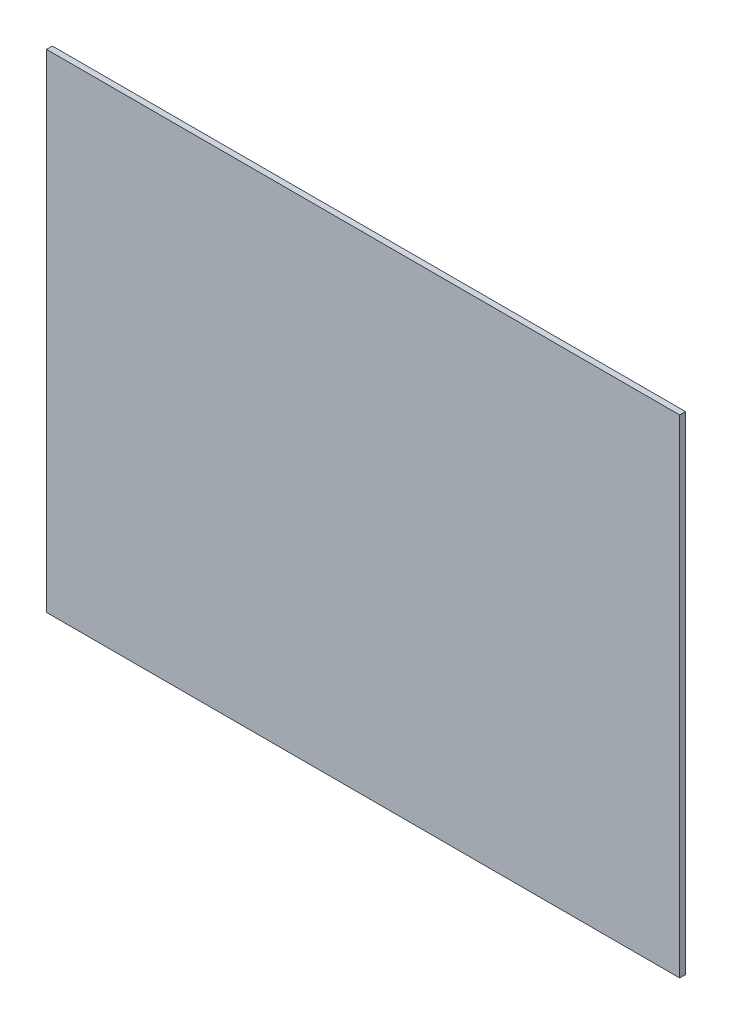
ISO-10303-21;
HEADER;
FILE_DESCRIPTION(('STEP AP214'),'2;1');
FILE_NAME('part.step','',(''),(''),'','','');
FILE_SCHEMA(('AUTOMOTIVE_DESIGN { 1 0 10303 214 1 1 1 1 }'));
ENDSEC;
DATA;
#1=APPLICATION_CONTEXT('core data for automotive mechanical design processes');
#2=APPLICATION_PROTOCOL_DEFINITION('international standard','automotive_design',2000,#1);
#3=PRODUCT_CONTEXT('',#1,'mechanical');
#4=PRODUCT('Part','Part','',(#3));
#5=PRODUCT_RELATED_PRODUCT_CATEGORY('part','',(#4));
#6=PRODUCT_DEFINITION_FORMATION('','',#4);
#7=PRODUCT_DEFINITION_CONTEXT('part definition',#1,'design');
#8=PRODUCT_DEFINITION('design','',#6,#7);
#9=PRODUCT_DEFINITION_SHAPE('','',#8);
#10=(LENGTH_UNIT() NAMED_UNIT(*) SI_UNIT(.MILLI.,.METRE.));
#11=(NAMED_UNIT(*) PLANE_ANGLE_UNIT() SI_UNIT($,.RADIAN.));
#12=(NAMED_UNIT(*) SI_UNIT($,.STERADIAN.) SOLID_ANGLE_UNIT());
#13=UNCERTAINTY_MEASURE_WITH_UNIT(LENGTH_MEASURE(1.E-05),#10,'distance_accuracy_value','');
#14=(GEOMETRIC_REPRESENTATION_CONTEXT(3) GLOBAL_UNCERTAINTY_ASSIGNED_CONTEXT((#13)) GLOBAL_UNIT_ASSIGNED_CONTEXT((#10,
#11,#12)) REPRESENTATION_CONTEXT('',''));
#15=CARTESIAN_POINT('',(0.,0.,0.));
#16=DIRECTION('',(0.,0.,1.));
#17=DIRECTION('',(1.,0.,0.));
#18=AXIS2_PLACEMENT_3D('',#15,#16,#17);
#19=CARTESIAN_POINT('',(163.1,-125.6,-3.));
#20=DIRECTION('',(1.,0.,0.));
#21=DIRECTION('',(0.,0.,-1.));
#22=AXIS2_PLACEMENT_3D('',#19,#20,#21);
#23=PLANE('',#22);
#24=DIRECTION('',(0.,1.,0.));
#25=VECTOR('',#24,1.);
#26=CARTESIAN_POINT('',(163.1,-125.6,0.));
#27=LINE('',#26,#25);
#28=CARTESIAN_POINT('',(163.1,-125.6,0.));
#29=VERTEX_POINT('',#28);
#30=CARTESIAN_POINT('',(163.1,125.6,0.));
#31=VERTEX_POINT('',#30);
#32=EDGE_CURVE('E109',#29,#31,#27,.T.);
#33=ORIENTED_EDGE('',*,*,#32,.F.);
#34=DIRECTION('',(0.,0.,1.));
#35=VECTOR('',#34,1.);
#36=CARTESIAN_POINT('',(163.1,-125.6,-3.));
#37=LINE('',#36,#35);
#38=CARTESIAN_POINT('',(163.1,-125.6,-3.));
#39=VERTEX_POINT('',#38);
#40=EDGE_CURVE('E11',#39,#29,#37,.T.);
#41=ORIENTED_EDGE('',*,*,#40,.F.);
#42=DIRECTION('',(0.,1.,0.));
#43=VECTOR('',#42,1.);
#44=CARTESIAN_POINT('',(163.1,-125.6,-3.));
#45=LINE('',#44,#43);
#46=CARTESIAN_POINT('',(163.1,125.6,-3.));
#47=VERTEX_POINT('',#46);
#48=EDGE_CURVE('E101',#39,#47,#45,.T.);
#49=ORIENTED_EDGE('',*,*,#48,.T.);
#50=DIRECTION('',(0.,0.,1.));
#51=VECTOR('',#50,1.);
#52=CARTESIAN_POINT('',(163.1,125.6,-3.));
#53=LINE('',#52,#51);
#54=EDGE_CURVE('E42',#47,#31,#53,.T.);
#55=ORIENTED_EDGE('',*,*,#54,.T.);
#56=EDGE_LOOP('',(#33,#41,#49,#55));
#57=FACE_BOUND('',#56,.T.);
#58=ADVANCED_FACE('F39',(#57),#23,.T.);
#59=CARTESIAN_POINT('',(-163.1,-125.6,-3.));
#60=DIRECTION('',(0.,-1.,0.));
#61=DIRECTION('',(0.,0.,-1.));
#62=AXIS2_PLACEMENT_3D('',#59,#60,#61);
#63=PLANE('',#62);
#64=DIRECTION('',(1.,0.,0.));
#65=VECTOR('',#64,1.);
#66=CARTESIAN_POINT('',(-163.1,-125.6,0.));
#67=LINE('',#66,#65);
#68=CARTESIAN_POINT('',(-163.1,-125.6,0.));
#69=VERTEX_POINT('',#68);
#70=EDGE_CURVE('E104',#69,#29,#67,.T.);
#71=ORIENTED_EDGE('',*,*,#70,.F.);
#72=DIRECTION('',(0.,0.,1.));
#73=VECTOR('',#72,1.);
#74=CARTESIAN_POINT('',(-163.1,-125.6,-3.));
#75=LINE('',#74,#73);
#76=CARTESIAN_POINT('',(-163.1,-125.6,-3.));
#77=VERTEX_POINT('',#76);
#78=EDGE_CURVE('E49',#77,#69,#75,.T.);
#79=ORIENTED_EDGE('',*,*,#78,.F.);
#80=DIRECTION('',(1.,0.,0.));
#81=VECTOR('',#80,1.);
#82=CARTESIAN_POINT('',(-163.1,-125.6,-3.));
#83=LINE('',#82,#81);
#84=EDGE_CURVE('E96',#77,#39,#83,.T.);
#85=ORIENTED_EDGE('',*,*,#84,.T.);
#86=ORIENTED_EDGE('',*,*,#40,.T.);
#87=EDGE_LOOP('',(#71,#79,#85,#86));
#88=FACE_BOUND('',#87,.T.);
#89=ADVANCED_FACE('F125',(#88),#63,.T.);
#90=CARTESIAN_POINT('',(-163.1,-125.6,-3.));
#91=DIRECTION('',(-1.,0.,0.));
#92=DIRECTION('',(0.,0.,1.));
#93=AXIS2_PLACEMENT_3D('',#90,#91,#92);
#94=PLANE('',#93);
#95=DIRECTION('',(0.,-1.,0.));
#96=VECTOR('',#95,1.);
#97=CARTESIAN_POINT('',(-163.1,-125.6,0.));
#98=LINE('',#97,#96);
#99=CARTESIAN_POINT('',(-163.1,125.6,0.));
#100=VERTEX_POINT('',#99);
#101=EDGE_CURVE('E90',#100,#69,#98,.T.);
#102=ORIENTED_EDGE('',*,*,#101,.F.);
#103=DIRECTION('',(0.,0.,1.));
#104=VECTOR('',#103,1.);
#105=CARTESIAN_POINT('',(-163.1,125.6,-3.));
#106=LINE('',#105,#104);
#107=CARTESIAN_POINT('',(-163.1,125.6,-3.));
#108=VERTEX_POINT('',#107);
#109=EDGE_CURVE('E85',#108,#100,#106,.T.);
#110=ORIENTED_EDGE('',*,*,#109,.F.);
#111=DIRECTION('',(0.,-1.,0.));
#112=VECTOR('',#111,1.);
#113=CARTESIAN_POINT('',(-163.1,-125.6,-3.));
#114=LINE('',#113,#112);
#115=EDGE_CURVE('E88',#108,#77,#114,.T.);
#116=ORIENTED_EDGE('',*,*,#115,.T.);
#117=ORIENTED_EDGE('',*,*,#78,.T.);
#118=EDGE_LOOP('',(#102,#110,#116,#117));
#119=FACE_BOUND('',#118,.T.);
#120=ADVANCED_FACE('F87',(#119),#94,.T.);
#121=CARTESIAN_POINT('',(-163.1,125.6,-3.));
#122=DIRECTION('',(0.,1.,0.));
#123=DIRECTION('',(0.,0.,1.));
#124=AXIS2_PLACEMENT_3D('',#121,#122,#123);
#125=PLANE('',#124);
#126=DIRECTION('',(-1.,0.,0.));
#127=VECTOR('',#126,1.);
#128=CARTESIAN_POINT('',(-163.1,125.6,0.));
#129=LINE('',#128,#127);
#130=EDGE_CURVE('E113',#31,#100,#129,.T.);
#131=ORIENTED_EDGE('',*,*,#130,.F.);
#132=ORIENTED_EDGE('',*,*,#54,.F.);
#133=DIRECTION('',(-1.,0.,0.));
#134=VECTOR('',#133,1.);
#135=CARTESIAN_POINT('',(-163.1,125.6,-3.));
#136=LINE('',#135,#134);
#137=EDGE_CURVE('E95',#47,#108,#136,.T.);
#138=ORIENTED_EDGE('',*,*,#137,.T.);
#139=ORIENTED_EDGE('',*,*,#109,.T.);
#140=EDGE_LOOP('',(#131,#132,#138,#139));
#141=FACE_BOUND('',#140,.T.);
#142=ADVANCED_FACE('F99',(#141),#125,.T.);
#143=CARTESIAN_POINT('',(0.,0.,-3.));
#144=DIRECTION('',(0.,0.,-1.));
#145=DIRECTION('',(-1.,0.,0.));
#146=AXIS2_PLACEMENT_3D('',#143,#144,#145);
#147=PLANE('',#146);
#148=ORIENTED_EDGE('',*,*,#48,.F.);
#149=ORIENTED_EDGE('',*,*,#84,.F.);
#150=ORIENTED_EDGE('',*,*,#115,.F.);
#151=ORIENTED_EDGE('',*,*,#137,.F.);
#152=EDGE_LOOP('',(#148,#149,#150,#151));
#153=FACE_BOUND('',#152,.T.);
#154=ADVANCED_FACE('F94',(#153),#147,.T.);
#155=CARTESIAN_POINT('',(0.,0.,0.));
#156=DIRECTION('',(0.,0.,-1.));
#157=DIRECTION('',(-1.,0.,0.));
#158=AXIS2_PLACEMENT_3D('',#155,#156,#157);
#159=PLANE('',#158);
#160=ORIENTED_EDGE('',*,*,#32,.T.);
#161=ORIENTED_EDGE('',*,*,#130,.T.);
#162=ORIENTED_EDGE('',*,*,#101,.T.);
#163=ORIENTED_EDGE('',*,*,#70,.T.);
#164=EDGE_LOOP('',(#160,#161,#162,#163));
#165=FACE_BOUND('',#164,.T.);
#166=ADVANCED_FACE('F124',(#165),#159,.F.);
#167=CLOSED_SHELL('',(#58,#89,#120,#142,#154,#166));
#168=MANIFOLD_SOLID_BREP('B2',#167);
#169=ADVANCED_BREP_SHAPE_REPRESENTATION('',(#18,#168),#14);
#170=SHAPE_DEFINITION_REPRESENTATION(#9,#169);
ENDSEC;
END-ISO-10303-21;
